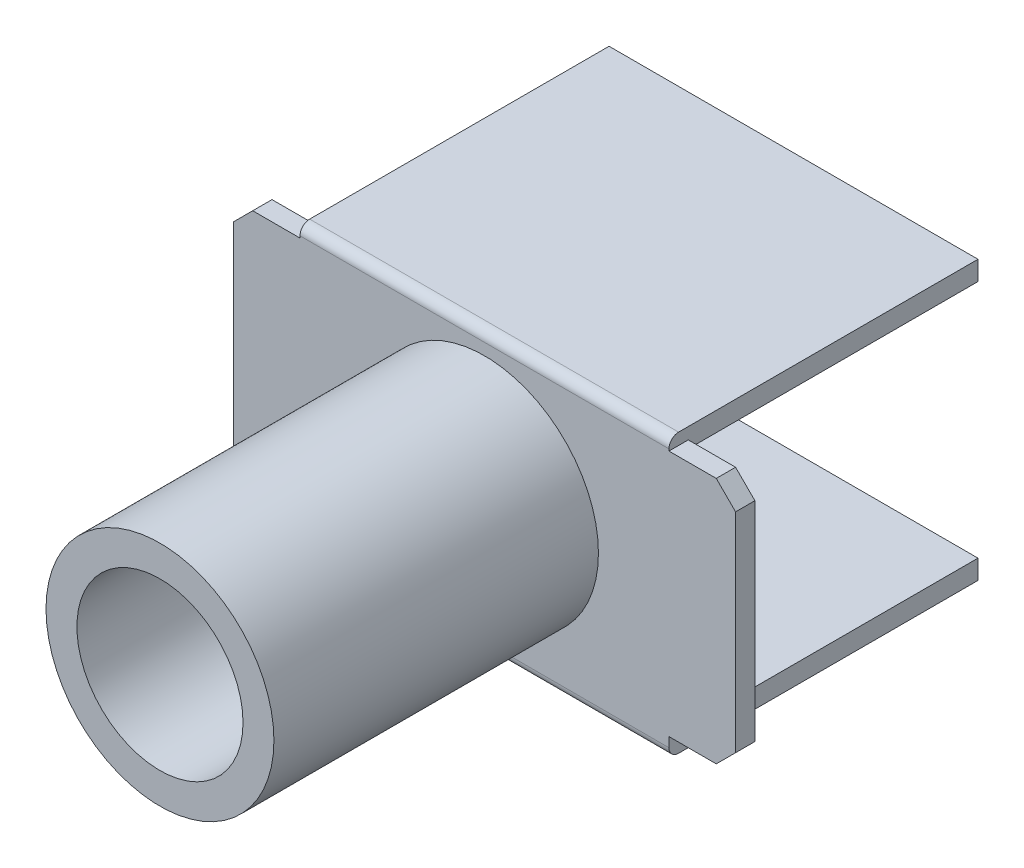
ISO-10303-21;
HEADER;
FILE_DESCRIPTION(('STEP AP214'),'2;1');
FILE_NAME('part.step','',(''),(''),'','','');
FILE_SCHEMA(('AUTOMOTIVE_DESIGN { 1 0 10303 214 1 1 1 1 }'));
ENDSEC;
DATA;
#1=APPLICATION_CONTEXT('core data for automotive mechanical design processes');
#2=APPLICATION_PROTOCOL_DEFINITION('international standard','automotive_design',2000,#1);
#3=PRODUCT_CONTEXT('',#1,'mechanical');
#4=PRODUCT('Part','Part','',(#3));
#5=PRODUCT_RELATED_PRODUCT_CATEGORY('part','',(#4));
#6=PRODUCT_DEFINITION_FORMATION('','',#4);
#7=PRODUCT_DEFINITION_CONTEXT('part definition',#1,'design');
#8=PRODUCT_DEFINITION('design','',#6,#7);
#9=PRODUCT_DEFINITION_SHAPE('','',#8);
#10=(LENGTH_UNIT() NAMED_UNIT(*) SI_UNIT(.MILLI.,.METRE.));
#11=(NAMED_UNIT(*) PLANE_ANGLE_UNIT() SI_UNIT($,.RADIAN.));
#12=(NAMED_UNIT(*) SI_UNIT($,.STERADIAN.) SOLID_ANGLE_UNIT());
#13=UNCERTAINTY_MEASURE_WITH_UNIT(LENGTH_MEASURE(1.E-05),#10,'distance_accuracy_value','');
#14=(GEOMETRIC_REPRESENTATION_CONTEXT(3) GLOBAL_UNCERTAINTY_ASSIGNED_CONTEXT((#13)) GLOBAL_UNIT_ASSIGNED_CONTEXT((#10,
#11,#12)) REPRESENTATION_CONTEXT('',''));
#15=CARTESIAN_POINT('',(0.,0.,0.));
#16=DIRECTION('',(0.,0.,1.));
#17=DIRECTION('',(1.,0.,0.));
#18=AXIS2_PLACEMENT_3D('',#15,#16,#17);
#19=CARTESIAN_POINT('',(-1.725,0.300000000000003,0.5));
#20=DIRECTION('',(1.,0.,0.));
#21=DIRECTION('',(0.,0.,-1.));
#22=AXIS2_PLACEMENT_3D('',#19,#20,#21);
#23=PLANE('',#22);
#24=DIRECTION('',(0.,0.,-1.));
#25=VECTOR('',#24,1.);
#26=CARTESIAN_POINT('',(-1.725,0.300000000000003,0.5));
#27=LINE('',#26,#25);
#28=CARTESIAN_POINT('',(-1.725,0.300000000000003,0.));
#29=VERTEX_POINT('',#28);
#30=CARTESIAN_POINT('',(-1.725,0.300000000000003,0.5));
#31=VERTEX_POINT('',#30);
#32=EDGE_CURVE('P0_E167',#29,#31,#27,.F.);
#33=ORIENTED_EDGE('',*,*,#32,.T.);
#34=DIRECTION('',(0.,1.,0.));
#35=VECTOR('',#34,1.);
#36=CARTESIAN_POINT('',(-1.725,0.300000000000003,0.5));
#37=LINE('',#36,#35);
#38=CARTESIAN_POINT('',(-1.725,0.0500000000000027,0.5));
#39=VERTEX_POINT('',#38);
#40=EDGE_CURVE('P0_E171',#31,#39,#37,.F.);
#41=ORIENTED_EDGE('',*,*,#40,.T.);
#42=CARTESIAN_POINT('',(-1.725,0.0500000000000036,0.25));
#43=DIRECTION('',(1.,0.,0.));
#44=DIRECTION('',(0.,1.,0.));
#45=AXIS2_PLACEMENT_3D('',#42,#43,#44);
#46=CIRCLE('',#45,0.25);
#47=CARTESIAN_POINT('',(-1.725,-0.199999999999997,0.25));
#48=VERTEX_POINT('',#47);
#49=EDGE_CURVE('P0_E20',#39,#48,#46,.T.);
#50=ORIENTED_EDGE('',*,*,#49,.T.);
#51=DIRECTION('',(0.,0.,1.));
#52=VECTOR('',#51,1.);
#53=CARTESIAN_POINT('',(-1.725,-0.199999999999997,-3.5));
#54=LINE('',#53,#52);
#55=CARTESIAN_POINT('',(-1.725,-0.199999999999997,-7.5));
#56=VERTEX_POINT('',#55);
#57=EDGE_CURVE('P0_E255',#48,#56,#54,.F.);
#58=ORIENTED_EDGE('',*,*,#57,.T.);
#59=DIRECTION('',(0.,1.,0.));
#60=VECTOR('',#59,1.);
#61=CARTESIAN_POINT('',(-1.725,0.300000000000003,-7.5));
#62=LINE('',#61,#60);
#63=CARTESIAN_POINT('',(-1.725,0.300000000000003,-7.5));
#64=VERTEX_POINT('',#63);
#65=EDGE_CURVE('P0_E179',#64,#56,#62,.F.);
#66=ORIENTED_EDGE('',*,*,#65,.F.);
#67=DIRECTION('',(0.,0.,1.));
#68=VECTOR('',#67,1.);
#69=CARTESIAN_POINT('',(-1.725,0.300000000000003,-3.5));
#70=LINE('',#69,#68);
#71=EDGE_CURVE('P0_E222',#29,#64,#70,.F.);
#72=ORIENTED_EDGE('',*,*,#71,.F.);
#73=EDGE_LOOP('',(#33,#41,#50,#58,#66,#72));
#74=FACE_BOUND('',#73,.T.);
#75=ADVANCED_FACE('P0_F17',(#74),#23,.T.);
#76=CARTESIAN_POINT('',(-1.725,0.300000000000003,-7.5));
#77=DIRECTION('',(0.,0.,-1.));
#78=DIRECTION('',(-1.,0.,0.));
#79=AXIS2_PLACEMENT_3D('',#76,#77,#78);
#80=PLANE('',#79);
#81=DIRECTION('',(1.,0.,0.));
#82=VECTOR('',#81,1.);
#83=CARTESIAN_POINT('',(-6.5,0.300000000000003,-7.5));
#84=LINE('',#83,#82);
#85=CARTESIAN_POINT('',(-11.275,0.300000000000002,-7.5));
#86=VERTEX_POINT('',#85);
#87=EDGE_CURVE('P0_E256',#64,#86,#84,.F.);
#88=ORIENTED_EDGE('',*,*,#87,.F.);
#89=ORIENTED_EDGE('',*,*,#65,.T.);
#90=DIRECTION('',(1.,0.,0.));
#91=VECTOR('',#90,1.);
#92=CARTESIAN_POINT('',(-6.5,-0.199999999999997,-7.5));
#93=LINE('',#92,#91);
#94=CARTESIAN_POINT('',(-11.275,-0.199999999999997,-7.5));
#95=VERTEX_POINT('',#94);
#96=EDGE_CURVE('P0_E309',#56,#95,#93,.F.);
#97=ORIENTED_EDGE('',*,*,#96,.T.);
#98=DIRECTION('',(0.,1.,0.));
#99=VECTOR('',#98,1.);
#100=CARTESIAN_POINT('',(-11.275,0.300000000000002,-7.5));
#101=LINE('',#100,#99);
#102=EDGE_CURVE('P0_E265',#86,#95,#101,.F.);
#103=ORIENTED_EDGE('',*,*,#102,.F.);
#104=EDGE_LOOP('',(#88,#89,#97,#103));
#105=FACE_BOUND('',#104,.T.);
#106=ADVANCED_FACE('P0_F324',(#105),#80,.T.);
#107=CARTESIAN_POINT('',(-11.275,0.300000000000002,-7.5));
#108=DIRECTION('',(-1.,0.,0.));
#109=DIRECTION('',(0.,0.,1.));
#110=AXIS2_PLACEMENT_3D('',#107,#108,#109);
#111=PLANE('',#110);
#112=ORIENTED_EDGE('',*,*,#102,.T.);
#113=DIRECTION('',(0.,0.,1.));
#114=VECTOR('',#113,1.);
#115=CARTESIAN_POINT('',(-11.275,-0.199999999999997,-3.5));
#116=LINE('',#115,#114);
#117=CARTESIAN_POINT('',(-11.275,-0.199999999999997,0.25));
#118=VERTEX_POINT('',#117);
#119=EDGE_CURVE('P0_E306',#95,#118,#116,.T.);
#120=ORIENTED_EDGE('',*,*,#119,.T.);
#121=CARTESIAN_POINT('',(-11.275,0.0500000000000024,0.25));
#122=DIRECTION('',(1.,0.,0.));
#123=DIRECTION('',(0.,1.,0.));
#124=AXIS2_PLACEMENT_3D('',#121,#122,#123);
#125=CIRCLE('',#124,0.25);
#126=CARTESIAN_POINT('',(-11.275,0.0500000000000021,0.5));
#127=VERTEX_POINT('',#126);
#128=EDGE_CURVE('P0_E182',#118,#127,#125,.F.);
#129=ORIENTED_EDGE('',*,*,#128,.T.);
#130=DIRECTION('',(0.,1.,0.));
#131=VECTOR('',#130,1.);
#132=CARTESIAN_POINT('',(-11.275,0.300000000000002,0.5));
#133=LINE('',#132,#131);
#134=CARTESIAN_POINT('',(-11.275,0.300000000000002,0.5));
#135=VERTEX_POINT('',#134);
#136=EDGE_CURVE('P0_E174',#127,#135,#133,.T.);
#137=ORIENTED_EDGE('',*,*,#136,.T.);
#138=DIRECTION('',(0.,0.,1.));
#139=VECTOR('',#138,1.);
#140=CARTESIAN_POINT('',(-11.275,0.300000000000002,-7.5));
#141=LINE('',#140,#139);
#142=CARTESIAN_POINT('',(-11.275,0.300000000000003,0.));
#143=VERTEX_POINT('',#142);
#144=EDGE_CURVE('P0_E263',#135,#143,#141,.F.);
#145=ORIENTED_EDGE('',*,*,#144,.T.);
#146=DIRECTION('',(0.,0.,1.));
#147=VECTOR('',#146,1.);
#148=CARTESIAN_POINT('',(-11.275,0.300000000000003,-3.5));
#149=LINE('',#148,#147);
#150=EDGE_CURVE('P0_E252',#86,#143,#149,.T.);
#151=ORIENTED_EDGE('',*,*,#150,.F.);
#152=EDGE_LOOP('',(#112,#120,#129,#137,#145,#151));
#153=FACE_BOUND('',#152,.T.);
#154=ADVANCED_FACE('P0_F327',(#153),#111,.T.);
#155=CARTESIAN_POINT('',(-1.725,6.50000015773294,-7.5));
#156=DIRECTION('',(1.,0.,0.));
#157=DIRECTION('',(0.,0.,-1.));
#158=AXIS2_PLACEMENT_3D('',#155,#156,#157);
#159=PLANE('',#158);
#160=DIRECTION('',(0.,1.,0.));
#161=VECTOR('',#160,1.);
#162=CARTESIAN_POINT('',(-1.725,6.50000015773294,-7.5));
#163=LINE('',#162,#161);
#164=CARTESIAN_POINT('',(-1.725,7.00000015773294,-7.5));
#165=VERTEX_POINT('',#164);
#166=CARTESIAN_POINT('',(-1.725,6.50000015773294,-7.5));
#167=VERTEX_POINT('',#166);
#168=EDGE_CURVE('P0_E293',#165,#167,#163,.F.);
#169=ORIENTED_EDGE('',*,*,#168,.F.);
#170=DIRECTION('',(0.,0.,1.));
#171=VECTOR('',#170,1.);
#172=CARTESIAN_POINT('',(-1.725,7.00000015773294,-3.5));
#173=LINE('',#172,#171);
#174=CARTESIAN_POINT('',(-1.725,7.00000015773294,0.25));
#175=VERTEX_POINT('',#174);
#176=EDGE_CURVE('P0_E308',#175,#165,#173,.F.);
#177=ORIENTED_EDGE('',*,*,#176,.F.);
#178=CARTESIAN_POINT('',(-1.725,6.75000015773294,0.25));
#179=DIRECTION('',(-1.,0.,0.));
#180=DIRECTION('',(0.,-1.,0.));
#181=AXIS2_PLACEMENT_3D('',#178,#179,#180);
#182=CIRCLE('',#181,0.25);
#183=CARTESIAN_POINT('',(-1.725,6.75000015773294,0.5));
#184=VERTEX_POINT('',#183);
#185=EDGE_CURVE('P0_E294',#175,#184,#182,.F.);
#186=ORIENTED_EDGE('',*,*,#185,.T.);
#187=DIRECTION('',(0.,1.,0.));
#188=VECTOR('',#187,1.);
#189=CARTESIAN_POINT('',(-1.725,6.50000015773294,0.5));
#190=LINE('',#189,#188);
#191=CARTESIAN_POINT('',(-1.725,6.70000000000001,0.5));
#192=VERTEX_POINT('',#191);
#193=EDGE_CURVE('P0_E244',#184,#192,#190,.F.);
#194=ORIENTED_EDGE('',*,*,#193,.T.);
#195=DIRECTION('',(0.,0.,-1.));
#196=VECTOR('',#195,1.);
#197=CARTESIAN_POINT('',(-1.725,6.70000000000001,-7.5));
#198=LINE('',#197,#196);
#199=CARTESIAN_POINT('',(-1.725,6.70000000000001,0.));
#200=VERTEX_POINT('',#199);
#201=EDGE_CURVE('P0_E240',#192,#200,#198,.T.);
#202=ORIENTED_EDGE('',*,*,#201,.T.);
#203=DIRECTION('',(0.,1.,0.));
#204=VECTOR('',#203,1.);
#205=CARTESIAN_POINT('',(-1.725,6.50000015773294,0.));
#206=LINE('',#205,#204);
#207=CARTESIAN_POINT('',(-1.725,6.50000015773294,0.));
#208=VERTEX_POINT('',#207);
#209=EDGE_CURVE('P0_E243',#200,#208,#206,.F.);
#210=ORIENTED_EDGE('',*,*,#209,.T.);
#211=DIRECTION('',(0.,0.,1.));
#212=VECTOR('',#211,1.);
#213=CARTESIAN_POINT('',(-1.725,6.50000015773294,-3.5));
#214=LINE('',#213,#212);
#215=EDGE_CURVE('P0_E234',#208,#167,#214,.F.);
#216=ORIENTED_EDGE('',*,*,#215,.T.);
#217=EDGE_LOOP('',(#169,#177,#186,#194,#202,#210,#216));
#218=FACE_BOUND('',#217,.T.);
#219=ADVANCED_FACE('P0_F418',(#218),#159,.T.);
#220=CARTESIAN_POINT('',(-11.275,6.50000015773294,-7.5));
#221=DIRECTION('',(0.,0.,-1.));
#222=DIRECTION('',(-1.,0.,0.));
#223=AXIS2_PLACEMENT_3D('',#220,#221,#222);
#224=PLANE('',#223);
#225=DIRECTION('',(1.,0.,0.));
#226=VECTOR('',#225,1.);
#227=CARTESIAN_POINT('',(-6.5,6.50000015773294,-7.5));
#228=LINE('',#227,#226);
#229=CARTESIAN_POINT('',(-11.275,6.50000015773294,-7.5));
#230=VERTEX_POINT('',#229);
#231=EDGE_CURVE('P0_E223',#167,#230,#228,.F.);
#232=ORIENTED_EDGE('',*,*,#231,.T.);
#233=DIRECTION('',(0.,1.,0.));
#234=VECTOR('',#233,1.);
#235=CARTESIAN_POINT('',(-11.275,6.50000015773294,-7.5));
#236=LINE('',#235,#234);
#237=CARTESIAN_POINT('',(-11.275,7.00000015773294,-7.5));
#238=VERTEX_POINT('',#237);
#239=EDGE_CURVE('P0_E216',#238,#230,#236,.F.);
#240=ORIENTED_EDGE('',*,*,#239,.F.);
#241=DIRECTION('',(1.,0.,0.));
#242=VECTOR('',#241,1.);
#243=CARTESIAN_POINT('',(-6.5,7.00000015773294,-7.5));
#244=LINE('',#243,#242);
#245=EDGE_CURVE('P0_E395',#165,#238,#244,.F.);
#246=ORIENTED_EDGE('',*,*,#245,.F.);
#247=ORIENTED_EDGE('',*,*,#168,.T.);
#248=EDGE_LOOP('',(#232,#240,#246,#247));
#249=FACE_BOUND('',#248,.T.);
#250=ADVANCED_FACE('P0_F432',(#249),#224,.T.);
#251=CARTESIAN_POINT('',(-11.275,6.50000015773294,0.5));
#252=DIRECTION('',(-1.,0.,0.));
#253=DIRECTION('',(0.,0.,1.));
#254=AXIS2_PLACEMENT_3D('',#251,#252,#253);
#255=PLANE('',#254);
#256=DIRECTION('',(0.,0.,1.));
#257=VECTOR('',#256,1.);
#258=CARTESIAN_POINT('',(-11.275,6.70000000000001,0.5));
#259=LINE('',#258,#257);
#260=CARTESIAN_POINT('',(-11.275,6.70000000000001,0.));
#261=VERTEX_POINT('',#260);
#262=CARTESIAN_POINT('',(-11.275,6.70000000000001,0.5));
#263=VERTEX_POINT('',#262);
#264=EDGE_CURVE('P0_E201',#261,#263,#259,.T.);
#265=ORIENTED_EDGE('',*,*,#264,.T.);
#266=DIRECTION('',(0.,1.,0.));
#267=VECTOR('',#266,1.);
#268=CARTESIAN_POINT('',(-11.275,6.50000015773294,0.5));
#269=LINE('',#268,#267);
#270=CARTESIAN_POINT('',(-11.275,6.75000015773294,0.5));
#271=VERTEX_POINT('',#270);
#272=EDGE_CURVE('P0_E204',#263,#271,#269,.T.);
#273=ORIENTED_EDGE('',*,*,#272,.T.);
#274=CARTESIAN_POINT('',(-11.275,6.75000015773294,0.25));
#275=DIRECTION('',(-1.,0.,0.));
#276=DIRECTION('',(0.,-1.,0.));
#277=AXIS2_PLACEMENT_3D('',#274,#275,#276);
#278=CIRCLE('',#277,0.25);
#279=CARTESIAN_POINT('',(-11.275,7.00000015773294,0.25));
#280=VERTEX_POINT('',#279);
#281=EDGE_CURVE('P0_E291',#271,#280,#278,.T.);
#282=ORIENTED_EDGE('',*,*,#281,.T.);
#283=DIRECTION('',(0.,0.,1.));
#284=VECTOR('',#283,1.);
#285=CARTESIAN_POINT('',(-11.275,7.00000015773294,-3.5));
#286=LINE('',#285,#284);
#287=EDGE_CURVE('P0_E230',#238,#280,#286,.T.);
#288=ORIENTED_EDGE('',*,*,#287,.F.);
#289=ORIENTED_EDGE('',*,*,#239,.T.);
#290=DIRECTION('',(0.,0.,1.));
#291=VECTOR('',#290,1.);
#292=CARTESIAN_POINT('',(-11.275,6.50000015773294,-3.5));
#293=LINE('',#292,#291);
#294=CARTESIAN_POINT('',(-11.275,6.50000015773294,0.));
#295=VERTEX_POINT('',#294);
#296=EDGE_CURVE('P0_E219',#230,#295,#293,.T.);
#297=ORIENTED_EDGE('',*,*,#296,.T.);
#298=DIRECTION('',(0.,1.,0.));
#299=VECTOR('',#298,1.);
#300=CARTESIAN_POINT('',(-11.275,6.50000015773294,0.));
#301=LINE('',#300,#299);
#302=EDGE_CURVE('P0_E205',#295,#261,#301,.T.);
#303=ORIENTED_EDGE('',*,*,#302,.T.);
#304=EDGE_LOOP('',(#265,#273,#282,#288,#289,#297,#303));
#305=FACE_BOUND('',#304,.T.);
#306=ADVANCED_FACE('P0_F427',(#305),#255,.T.);
#307=CARTESIAN_POINT('',(-6.5,6.50000015773294,-3.5));
#308=DIRECTION('',(0.,1.,0.));
#309=DIRECTION('',(0.,0.,1.));
#310=AXIS2_PLACEMENT_3D('',#307,#308,#309);
#311=PLANE('',#310);
#312=ORIENTED_EDGE('',*,*,#296,.F.);
#313=ORIENTED_EDGE('',*,*,#231,.F.);
#314=ORIENTED_EDGE('',*,*,#215,.F.);
#315=DIRECTION('',(1.,0.,0.));
#316=VECTOR('',#315,1.);
#317=CARTESIAN_POINT('',(-6.5,6.50000015773294,0.));
#318=LINE('',#317,#316);
#319=EDGE_CURVE('P0_E226',#208,#295,#318,.F.);
#320=ORIENTED_EDGE('',*,*,#319,.T.);
#321=EDGE_LOOP('',(#312,#313,#314,#320));
#322=FACE_BOUND('',#321,.T.);
#323=ADVANCED_FACE('P0_F436',(#322),#311,.F.);
#324=CARTESIAN_POINT('',(-6.5,0.300000000000003,-3.5));
#325=DIRECTION('',(0.,1.,0.));
#326=DIRECTION('',(0.,0.,1.));
#327=AXIS2_PLACEMENT_3D('',#324,#325,#326);
#328=PLANE('',#327);
#329=ORIENTED_EDGE('',*,*,#87,.T.);
#330=ORIENTED_EDGE('',*,*,#150,.T.);
#331=DIRECTION('',(1.,0.,0.));
#332=VECTOR('',#331,1.);
#333=CARTESIAN_POINT('',(-6.5,0.300000000000002,0.));
#334=LINE('',#333,#332);
#335=EDGE_CURVE('P0_E280',#143,#29,#334,.T.);
#336=ORIENTED_EDGE('',*,*,#335,.T.);
#337=ORIENTED_EDGE('',*,*,#71,.T.);
#338=EDGE_LOOP('',(#329,#330,#336,#337));
#339=FACE_BOUND('',#338,.T.);
#340=ADVANCED_FACE('P0_F332',(#339),#328,.T.);
#341=CARTESIAN_POINT('',(-6.5,-0.199999999999997,-3.5));
#342=DIRECTION('',(0.,1.,0.));
#343=DIRECTION('',(0.,0.,1.));
#344=AXIS2_PLACEMENT_3D('',#341,#342,#343);
#345=PLANE('',#344);
#346=ORIENTED_EDGE('',*,*,#119,.F.);
#347=ORIENTED_EDGE('',*,*,#96,.F.);
#348=ORIENTED_EDGE('',*,*,#57,.F.);
#349=DIRECTION('',(1.,0.,0.));
#350=VECTOR('',#349,1.);
#351=CARTESIAN_POINT('',(-6.5,-0.199999999999997,0.25));
#352=LINE('',#351,#350);
#353=EDGE_CURVE('P0_E163',#118,#48,#352,.T.);
#354=ORIENTED_EDGE('',*,*,#353,.F.);
#355=EDGE_LOOP('',(#346,#347,#348,#354));
#356=FACE_BOUND('',#355,.T.);
#357=ADVANCED_FACE('P0_F326',(#356),#345,.F.);
#358=CARTESIAN_POINT('',(-6.5,7.00000015773294,-3.5));
#359=DIRECTION('',(0.,1.,0.));
#360=DIRECTION('',(0.,0.,1.));
#361=AXIS2_PLACEMENT_3D('',#358,#359,#360);
#362=PLANE('',#361);
#363=ORIENTED_EDGE('',*,*,#245,.T.);
#364=ORIENTED_EDGE('',*,*,#287,.T.);
#365=DIRECTION('',(-1.,0.,0.));
#366=VECTOR('',#365,1.);
#367=CARTESIAN_POINT('',(-6.5,7.00000015773294,0.25));
#368=LINE('',#367,#366);
#369=EDGE_CURVE('P0_E211',#175,#280,#368,.T.);
#370=ORIENTED_EDGE('',*,*,#369,.F.);
#371=ORIENTED_EDGE('',*,*,#176,.T.);
#372=EDGE_LOOP('',(#363,#364,#370,#371));
#373=FACE_BOUND('',#372,.T.);
#374=ADVANCED_FACE('P0_F429',(#373),#362,.T.);
#375=CARTESIAN_POINT('',(-6.5,3.5,0.));
#376=DIRECTION('',(0.,0.,1.));
#377=DIRECTION('',(1.,0.,0.));
#378=AXIS2_PLACEMENT_3D('',#375,#376,#377);
#379=PLANE('',#378);
#380=DIRECTION('',(1.,0.,0.));
#381=VECTOR('',#380,1.);
#382=CARTESIAN_POINT('',(-13.,6.70000000000001,0.));
#383=LINE('',#382,#381);
#384=CARTESIAN_POINT('',(-0.5,6.70000000000001,0.));
#385=VERTEX_POINT('',#384);
#386=EDGE_CURVE('P0_E369',#385,#200,#383,.F.);
#387=ORIENTED_EDGE('',*,*,#386,.F.);
#388=DIRECTION('',(-0.707106781186547,0.707106781186548,0.));
#389=VECTOR('',#388,1.);
#390=CARTESIAN_POINT('',(-0.25,6.45000000000001,0.));
#391=LINE('',#390,#389);
#392=CARTESIAN_POINT('',(0.,6.20000000000001,0.));
#393=VERTEX_POINT('',#392);
#394=EDGE_CURVE('P0_E375',#393,#385,#391,.T.);
#395=ORIENTED_EDGE('',*,*,#394,.F.);
#396=DIRECTION('',(0.,1.,0.));
#397=VECTOR('',#396,1.);
#398=CARTESIAN_POINT('',(0.,6.70000000000001,0.));
#399=LINE('',#398,#397);
#400=CARTESIAN_POINT('',(0.,0.800000000000004,0.));
#401=VERTEX_POINT('',#400);
#402=EDGE_CURVE('P0_E380',#401,#393,#399,.T.);
#403=ORIENTED_EDGE('',*,*,#402,.F.);
#404=DIRECTION('',(0.707106781186547,0.707106781186548,0.));
#405=VECTOR('',#404,1.);
#406=CARTESIAN_POINT('',(-0.25,0.550000000000004,0.));
#407=LINE('',#406,#405);
#408=CARTESIAN_POINT('',(-0.5,0.300000000000004,0.));
#409=VERTEX_POINT('',#408);
#410=EDGE_CURVE('P0_E340',#409,#401,#407,.T.);
#411=ORIENTED_EDGE('',*,*,#410,.F.);
#412=DIRECTION('',(1.,0.,0.));
#413=VECTOR('',#412,1.);
#414=CARTESIAN_POINT('',(0.,0.300000000000004,0.));
#415=LINE('',#414,#413);
#416=EDGE_CURVE('P0_E286',#29,#409,#415,.T.);
#417=ORIENTED_EDGE('',*,*,#416,.F.);
#418=ORIENTED_EDGE('',*,*,#335,.F.);
#419=DIRECTION('',(1.,0.,0.));
#420=VECTOR('',#419,1.);
#421=CARTESIAN_POINT('',(-6.5,0.300000000000002,0.));
#422=LINE('',#421,#420);
#423=CARTESIAN_POINT('',(-12.5,0.300000000000003,0.));
#424=VERTEX_POINT('',#423);
#425=EDGE_CURVE('P0_E283',#424,#143,#422,.T.);
#426=ORIENTED_EDGE('',*,*,#425,.F.);
#427=DIRECTION('',(0.707106781186548,-0.707106781186547,0.));
#428=VECTOR('',#427,1.);
#429=CARTESIAN_POINT('',(-13.,0.800000000000002,0.));
#430=LINE('',#429,#428);
#431=CARTESIAN_POINT('',(-13.,0.800000000000003,0.));
#432=VERTEX_POINT('',#431);
#433=EDGE_CURVE('P0_E229',#432,#424,#430,.T.);
#434=ORIENTED_EDGE('',*,*,#433,.F.);
#435=DIRECTION('',(0.,1.,0.));
#436=VECTOR('',#435,1.);
#437=CARTESIAN_POINT('',(-13.,0.300000000000002,0.));
#438=LINE('',#437,#436);
#439=CARTESIAN_POINT('',(-13.,6.20000000000001,0.));
#440=VERTEX_POINT('',#439);
#441=EDGE_CURVE('P0_E359',#440,#432,#438,.F.);
#442=ORIENTED_EDGE('',*,*,#441,.F.);
#443=DIRECTION('',(-0.707106781186548,-0.707106781186548,0.));
#444=VECTOR('',#443,1.);
#445=CARTESIAN_POINT('',(-12.75,6.45000000000001,0.));
#446=LINE('',#445,#444);
#447=CARTESIAN_POINT('',(-12.5,6.70000000000001,0.));
#448=VERTEX_POINT('',#447);
#449=EDGE_CURVE('P0_E365',#448,#440,#446,.T.);
#450=ORIENTED_EDGE('',*,*,#449,.F.);
#451=DIRECTION('',(1.,0.,0.));
#452=VECTOR('',#451,1.);
#453=CARTESIAN_POINT('',(-13.,6.70000000000001,0.));
#454=LINE('',#453,#452);
#455=EDGE_CURVE('P0_E208',#261,#448,#454,.F.);
#456=ORIENTED_EDGE('',*,*,#455,.F.);
#457=ORIENTED_EDGE('',*,*,#302,.F.);
#458=ORIENTED_EDGE('',*,*,#319,.F.);
#459=ORIENTED_EDGE('',*,*,#209,.F.);
#460=EDGE_LOOP('',(#387,#395,#403,#411,#417,#418,#426,#434,#442,#450,#456,#457,#458,#459));
#461=FACE_BOUND('',#460,.T.);
#462=ADVANCED_FACE('P0_F338',(#461),#379,.F.);
#463=CARTESIAN_POINT('',(-6.5,0.050000000000003,0.25));
#464=DIRECTION('',(1.,0.,0.));
#465=DIRECTION('',(0.,1.,0.));
#466=AXIS2_PLACEMENT_3D('',#463,#464,#465);
#467=CYLINDRICAL_SURFACE('',#466,0.25);
#468=ORIENTED_EDGE('',*,*,#128,.F.);
#469=ORIENTED_EDGE('',*,*,#353,.T.);
#470=ORIENTED_EDGE('',*,*,#49,.F.);
#471=DIRECTION('',(1.,0.,0.));
#472=VECTOR('',#471,1.);
#473=CARTESIAN_POINT('',(-6.5,0.0500000000000019,0.5));
#474=LINE('',#473,#472);
#475=EDGE_CURVE('P0_E160',#127,#39,#474,.T.);
#476=ORIENTED_EDGE('',*,*,#475,.F.);
#477=EDGE_LOOP('',(#468,#469,#470,#476));
#478=FACE_BOUND('',#477,.T.);
#479=ADVANCED_FACE('P0_F159',(#478),#467,.T.);
#480=CARTESIAN_POINT('',(0.,0.300000000000004,0.));
#481=DIRECTION('',(0.,-1.,0.));
#482=DIRECTION('',(0.,0.,-1.));
#483=AXIS2_PLACEMENT_3D('',#480,#481,#482);
#484=PLANE('',#483);
#485=DIRECTION('',(0.,0.,1.));
#486=VECTOR('',#485,1.);
#487=CARTESIAN_POINT('',(-0.5,0.300000000000004,0.));
#488=LINE('',#487,#486);
#489=CARTESIAN_POINT('',(-0.5,0.300000000000004,0.5));
#490=VERTEX_POINT('',#489);
#491=EDGE_CURVE('P0_E288',#490,#409,#488,.F.);
#492=ORIENTED_EDGE('',*,*,#491,.F.);
#493=DIRECTION('',(1.,0.,0.));
#494=VECTOR('',#493,1.);
#495=CARTESIAN_POINT('',(-6.5,0.300000000000003,0.5));
#496=LINE('',#495,#494);
#497=EDGE_CURVE('P0_E175',#31,#490,#496,.T.);
#498=ORIENTED_EDGE('',*,*,#497,.F.);
#499=ORIENTED_EDGE('',*,*,#32,.F.);
#500=ORIENTED_EDGE('',*,*,#416,.T.);
#501=EDGE_LOOP('',(#492,#498,#499,#500));
#502=FACE_BOUND('',#501,.T.);
#503=ADVANCED_FACE('P0_F343',(#502),#484,.T.);
#504=CARTESIAN_POINT('',(-0.25,0.550000000000004,0.));
#505=DIRECTION('',(0.707106781186548,-0.707106781186547,0.));
#506=DIRECTION('',(0.707106781186547,0.707106781186548,0.));
#507=AXIS2_PLACEMENT_3D('',#504,#505,#506);
#508=PLANE('',#507);
#509=ORIENTED_EDGE('',*,*,#410,.T.);
#510=DIRECTION('',(0.,0.,-1.));
#511=VECTOR('',#510,1.);
#512=CARTESIAN_POINT('',(0.,0.800000000000004,0.));
#513=LINE('',#512,#511);
#514=CARTESIAN_POINT('',(0.,0.800000000000004,0.5));
#515=VERTEX_POINT('',#514);
#516=EDGE_CURVE('P0_E382',#515,#401,#513,.T.);
#517=ORIENTED_EDGE('',*,*,#516,.F.);
#518=DIRECTION('',(0.707106781186548,0.707106781186547,0.));
#519=VECTOR('',#518,1.);
#520=CARTESIAN_POINT('',(-0.5,0.300000000000004,0.5));
#521=LINE('',#520,#519);
#522=EDGE_CURVE('P0_E275',#490,#515,#521,.T.);
#523=ORIENTED_EDGE('',*,*,#522,.F.);
#524=ORIENTED_EDGE('',*,*,#491,.T.);
#525=EDGE_LOOP('',(#509,#517,#523,#524));
#526=FACE_BOUND('',#525,.T.);
#527=ADVANCED_FACE('P0_F462',(#526),#508,.T.);
#528=CARTESIAN_POINT('',(0.,6.70000000000001,0.));
#529=DIRECTION('',(1.,0.,0.));
#530=DIRECTION('',(0.,0.,-1.));
#531=AXIS2_PLACEMENT_3D('',#528,#529,#530);
#532=PLANE('',#531);
#533=ORIENTED_EDGE('',*,*,#516,.T.);
#534=ORIENTED_EDGE('',*,*,#402,.T.);
#535=DIRECTION('',(0.,0.,1.));
#536=VECTOR('',#535,1.);
#537=CARTESIAN_POINT('',(0.,6.20000000000001,0.));
#538=LINE('',#537,#536);
#539=CARTESIAN_POINT('',(0.,6.20000000000001,0.5));
#540=VERTEX_POINT('',#539);
#541=EDGE_CURVE('P0_E377',#540,#393,#538,.F.);
#542=ORIENTED_EDGE('',*,*,#541,.F.);
#543=DIRECTION('',(0.,1.,0.));
#544=VECTOR('',#543,1.);
#545=CARTESIAN_POINT('',(0.,3.5,0.5));
#546=LINE('',#545,#544);
#547=EDGE_CURVE('P0_E349',#515,#540,#546,.T.);
#548=ORIENTED_EDGE('',*,*,#547,.F.);
#549=EDGE_LOOP('',(#533,#534,#542,#548));
#550=FACE_BOUND('',#549,.T.);
#551=ADVANCED_FACE('P0_F461',(#550),#532,.T.);
#552=CARTESIAN_POINT('',(-0.25,6.45000000000001,0.));
#553=DIRECTION('',(0.707106781186548,0.707106781186547,0.));
#554=DIRECTION('',(-0.707106781186547,0.707106781186548,0.));
#555=AXIS2_PLACEMENT_3D('',#552,#553,#554);
#556=PLANE('',#555);
#557=ORIENTED_EDGE('',*,*,#394,.T.);
#558=DIRECTION('',(0.,0.,1.));
#559=VECTOR('',#558,1.);
#560=CARTESIAN_POINT('',(-0.5,6.70000000000001,0.));
#561=LINE('',#560,#559);
#562=CARTESIAN_POINT('',(-0.5,6.70000000000001,0.5));
#563=VERTEX_POINT('',#562);
#564=EDGE_CURVE('P0_E372',#563,#385,#561,.F.);
#565=ORIENTED_EDGE('',*,*,#564,.F.);
#566=DIRECTION('',(-0.707106781186548,0.707106781186547,0.));
#567=VECTOR('',#566,1.);
#568=CARTESIAN_POINT('',(0.,6.20000000000001,0.5));
#569=LINE('',#568,#567);
#570=EDGE_CURVE('P0_E249',#540,#563,#569,.T.);
#571=ORIENTED_EDGE('',*,*,#570,.F.);
#572=ORIENTED_EDGE('',*,*,#541,.T.);
#573=EDGE_LOOP('',(#557,#565,#571,#572));
#574=FACE_BOUND('',#573,.T.);
#575=ADVANCED_FACE('P0_F456',(#574),#556,.T.);
#576=CARTESIAN_POINT('',(-13.,6.70000000000001,0.));
#577=DIRECTION('',(0.,1.,0.));
#578=DIRECTION('',(0.,0.,1.));
#579=AXIS2_PLACEMENT_3D('',#576,#577,#578);
#580=PLANE('',#579);
#581=ORIENTED_EDGE('',*,*,#564,.T.);
#582=ORIENTED_EDGE('',*,*,#386,.T.);
#583=ORIENTED_EDGE('',*,*,#201,.F.);
#584=DIRECTION('',(1.,0.,0.));
#585=VECTOR('',#584,1.);
#586=CARTESIAN_POINT('',(-6.5,6.70000000000001,0.5));
#587=LINE('',#586,#585);
#588=EDGE_CURVE('P0_E195',#563,#192,#587,.F.);
#589=ORIENTED_EDGE('',*,*,#588,.F.);
#590=EDGE_LOOP('',(#581,#582,#583,#589));
#591=FACE_BOUND('',#590,.T.);
#592=ADVANCED_FACE('P0_F459',(#591),#580,.T.);
#593=CARTESIAN_POINT('',(-6.5,6.75000015773294,0.25));
#594=DIRECTION('',(-1.,0.,0.));
#595=DIRECTION('',(0.,-1.,0.));
#596=AXIS2_PLACEMENT_3D('',#593,#594,#595);
#597=CYLINDRICAL_SURFACE('',#596,0.25);
#598=ORIENTED_EDGE('',*,*,#185,.F.);
#599=ORIENTED_EDGE('',*,*,#369,.T.);
#600=ORIENTED_EDGE('',*,*,#281,.F.);
#601=DIRECTION('',(1.,0.,0.));
#602=VECTOR('',#601,1.);
#603=CARTESIAN_POINT('',(-6.5,6.75000015773294,0.5));
#604=LINE('',#603,#602);
#605=EDGE_CURVE('P0_E191',#184,#271,#604,.F.);
#606=ORIENTED_EDGE('',*,*,#605,.F.);
#607=EDGE_LOOP('',(#598,#599,#600,#606));
#608=FACE_BOUND('',#607,.T.);
#609=ADVANCED_FACE('P0_F423',(#608),#597,.T.);
#610=CARTESIAN_POINT('',(-13.,6.70000000000001,0.));
#611=DIRECTION('',(0.,1.,0.));
#612=DIRECTION('',(0.,0.,1.));
#613=AXIS2_PLACEMENT_3D('',#610,#611,#612);
#614=PLANE('',#613);
#615=DIRECTION('',(0.,0.,1.));
#616=VECTOR('',#615,1.);
#617=CARTESIAN_POINT('',(-12.5,6.70000000000001,0.));
#618=LINE('',#617,#616);
#619=CARTESIAN_POINT('',(-12.5,6.70000000000001,0.5));
#620=VERTEX_POINT('',#619);
#621=EDGE_CURVE('P0_E210',#620,#448,#618,.F.);
#622=ORIENTED_EDGE('',*,*,#621,.F.);
#623=DIRECTION('',(1.,0.,0.));
#624=VECTOR('',#623,1.);
#625=CARTESIAN_POINT('',(-6.5,6.70000000000001,0.5));
#626=LINE('',#625,#624);
#627=EDGE_CURVE('P0_E194',#263,#620,#626,.F.);
#628=ORIENTED_EDGE('',*,*,#627,.F.);
#629=ORIENTED_EDGE('',*,*,#264,.F.);
#630=ORIENTED_EDGE('',*,*,#455,.T.);
#631=EDGE_LOOP('',(#622,#628,#629,#630));
#632=FACE_BOUND('',#631,.T.);
#633=ADVANCED_FACE('P0_F443',(#632),#614,.T.);
#634=CARTESIAN_POINT('',(-12.75,6.45000000000001,0.));
#635=DIRECTION('',(-0.707106781186548,0.707106781186548,0.));
#636=DIRECTION('',(-0.707106781186548,-0.707106781186548,0.));
#637=AXIS2_PLACEMENT_3D('',#634,#635,#636);
#638=PLANE('',#637);
#639=ORIENTED_EDGE('',*,*,#449,.T.);
#640=DIRECTION('',(0.,0.,1.));
#641=VECTOR('',#640,1.);
#642=CARTESIAN_POINT('',(-13.,6.20000000000001,0.));
#643=LINE('',#642,#641);
#644=CARTESIAN_POINT('',(-13.,6.20000000000001,0.5));
#645=VERTEX_POINT('',#644);
#646=EDGE_CURVE('P0_E362',#645,#440,#643,.F.);
#647=ORIENTED_EDGE('',*,*,#646,.F.);
#648=DIRECTION('',(-0.707106781186549,-0.707106781186546,0.));
#649=VECTOR('',#648,1.);
#650=CARTESIAN_POINT('',(-12.5,6.70000000000001,0.5));
#651=LINE('',#650,#649);
#652=EDGE_CURVE('P0_E198',#620,#645,#651,.T.);
#653=ORIENTED_EDGE('',*,*,#652,.F.);
#654=ORIENTED_EDGE('',*,*,#621,.T.);
#655=EDGE_LOOP('',(#639,#647,#653,#654));
#656=FACE_BOUND('',#655,.T.);
#657=ADVANCED_FACE('P0_F487',(#656),#638,.T.);
#658=CARTESIAN_POINT('',(-13.,0.300000000000002,0.));
#659=DIRECTION('',(-1.,0.,0.));
#660=DIRECTION('',(0.,0.,1.));
#661=AXIS2_PLACEMENT_3D('',#658,#659,#660);
#662=PLANE('',#661);
#663=DIRECTION('',(0.,0.,1.));
#664=VECTOR('',#663,1.);
#665=CARTESIAN_POINT('',(-13.,0.800000000000002,0.));
#666=LINE('',#665,#664);
#667=CARTESIAN_POINT('',(-13.,0.800000000000003,0.5));
#668=VERTEX_POINT('',#667);
#669=EDGE_CURVE('P0_E356',#668,#432,#666,.F.);
#670=ORIENTED_EDGE('',*,*,#669,.F.);
#671=DIRECTION('',(0.,1.,0.));
#672=VECTOR('',#671,1.);
#673=CARTESIAN_POINT('',(-13.,3.5,0.5));
#674=LINE('',#673,#672);
#675=EDGE_CURVE('P0_E449',#645,#668,#674,.F.);
#676=ORIENTED_EDGE('',*,*,#675,.F.);
#677=ORIENTED_EDGE('',*,*,#646,.T.);
#678=ORIENTED_EDGE('',*,*,#441,.T.);
#679=EDGE_LOOP('',(#670,#676,#677,#678));
#680=FACE_BOUND('',#679,.T.);
#681=ADVANCED_FACE('P0_F484',(#680),#662,.T.);
#682=CARTESIAN_POINT('',(-12.75,0.550000000000002,0.));
#683=DIRECTION('',(-0.707106781186547,-0.707106781186548,0.));
#684=DIRECTION('',(0.707106781186548,-0.707106781186547,0.));
#685=AXIS2_PLACEMENT_3D('',#682,#683,#684);
#686=PLANE('',#685);
#687=ORIENTED_EDGE('',*,*,#433,.T.);
#688=DIRECTION('',(0.,0.,-1.));
#689=VECTOR('',#688,1.);
#690=CARTESIAN_POINT('',(-12.5,0.300000000000004,0.));
#691=LINE('',#690,#689);
#692=CARTESIAN_POINT('',(-12.5,0.300000000000003,0.5));
#693=VERTEX_POINT('',#692);
#694=EDGE_CURVE('P0_E35',#693,#424,#691,.T.);
#695=ORIENTED_EDGE('',*,*,#694,.F.);
#696=DIRECTION('',(0.707106781186548,-0.707106781186547,0.));
#697=VECTOR('',#696,1.);
#698=CARTESIAN_POINT('',(-13.,0.800000000000002,0.5));
#699=LINE('',#698,#697);
#700=EDGE_CURVE('P0_E26',#668,#693,#699,.T.);
#701=ORIENTED_EDGE('',*,*,#700,.F.);
#702=ORIENTED_EDGE('',*,*,#669,.T.);
#703=EDGE_LOOP('',(#687,#695,#701,#702));
#704=FACE_BOUND('',#703,.T.);
#705=ADVANCED_FACE('P0_F478',(#704),#686,.T.);
#706=CARTESIAN_POINT('',(0.,0.300000000000004,0.));
#707=DIRECTION('',(0.,-1.,0.));
#708=DIRECTION('',(0.,0.,-1.));
#709=AXIS2_PLACEMENT_3D('',#706,#707,#708);
#710=PLANE('',#709);
#711=ORIENTED_EDGE('',*,*,#694,.T.);
#712=ORIENTED_EDGE('',*,*,#425,.T.);
#713=ORIENTED_EDGE('',*,*,#144,.F.);
#714=DIRECTION('',(1.,0.,0.));
#715=VECTOR('',#714,1.);
#716=CARTESIAN_POINT('',(-6.5,0.300000000000002,0.5));
#717=LINE('',#716,#715);
#718=EDGE_CURVE('P0_E11',#693,#135,#717,.T.);
#719=ORIENTED_EDGE('',*,*,#718,.F.);
#720=EDGE_LOOP('',(#711,#712,#713,#719));
#721=FACE_BOUND('',#720,.T.);
#722=ADVANCED_FACE('P0_F473',(#721),#710,.T.);
#723=CARTESIAN_POINT('',(-6.5,3.5,0.5));
#724=DIRECTION('',(0.,0.,1.));
#725=DIRECTION('',(1.,0.,0.));
#726=AXIS2_PLACEMENT_3D('',#723,#724,#725);
#727=PLANE('',#726);
#728=ORIENTED_EDGE('',*,*,#718,.T.);
#729=ORIENTED_EDGE('',*,*,#136,.F.);
#730=ORIENTED_EDGE('',*,*,#475,.T.);
#731=ORIENTED_EDGE('',*,*,#40,.F.);
#732=ORIENTED_EDGE('',*,*,#497,.T.);
#733=ORIENTED_EDGE('',*,*,#522,.T.);
#734=ORIENTED_EDGE('',*,*,#547,.T.);
#735=ORIENTED_EDGE('',*,*,#570,.T.);
#736=ORIENTED_EDGE('',*,*,#588,.T.);
#737=ORIENTED_EDGE('',*,*,#193,.F.);
#738=ORIENTED_EDGE('',*,*,#605,.T.);
#739=ORIENTED_EDGE('',*,*,#272,.F.);
#740=ORIENTED_EDGE('',*,*,#627,.T.);
#741=ORIENTED_EDGE('',*,*,#652,.T.);
#742=ORIENTED_EDGE('',*,*,#675,.T.);
#743=ORIENTED_EDGE('',*,*,#700,.T.);
#744=EDGE_LOOP('',(#728,#729,#730,#731,#732,#733,#734,#735,#736,#737,#738,#739,#740,#741,#742,#743));
#745=FACE_BOUND('',#744,.T.);
#746=ADVANCED_FACE('P0_F169',(#745),#727,.T.);
#747=CLOSED_SHELL('',(#75,#106,#154,#219,#250,#306,#323,#340,#357,#374,#462,#479,#503,#527,#551,
#575,#592,#609,#633,#657,#681,#705,#722,#746));
#748=MANIFOLD_SOLID_BREP('P0_B1',#747);
#749=CARTESIAN_POINT('',(-6.5,3.5,0.5));
#750=DIRECTION('',(0.,0.,1.));
#751=DIRECTION('',(1.,0.,0.));
#752=AXIS2_PLACEMENT_3D('',#749,#750,#751);
#753=CYLINDRICAL_SURFACE('',#752,2.15);
#754=CARTESIAN_POINT('',(-6.5,3.5,0.5));
#755=DIRECTION('',(0.,0.,1.));
#756=DIRECTION('',(1.,0.,0.));
#757=AXIS2_PLACEMENT_3D('',#754,#755,#756);
#758=CIRCLE('',#757,2.15);
#759=CARTESIAN_POINT('',(-4.35,3.5,0.5));
#760=VERTEX_POINT('',#759);
#761=EDGE_CURVE('P1_E27',#760,#760,#758,.T.);
#762=ORIENTED_EDGE('',*,*,#761,.F.);
#763=EDGE_LOOP('',(#762));
#764=FACE_BOUND('',#763,.T.);
#765=CARTESIAN_POINT('',(-6.5,3.5,8.9));
#766=DIRECTION('',(0.,0.,1.));
#767=DIRECTION('',(1.,0.,0.));
#768=AXIS2_PLACEMENT_3D('',#765,#766,#767);
#769=CIRCLE('',#768,2.15);
#770=CARTESIAN_POINT('',(-4.35,3.5,8.9));
#771=VERTEX_POINT('',#770);
#772=EDGE_CURVE('P1_E18',#771,#771,#769,.T.);
#773=ORIENTED_EDGE('',*,*,#772,.T.);
#774=EDGE_LOOP('',(#773));
#775=FACE_BOUND('',#774,.T.);
#776=ADVANCED_FACE('P1_F15',(#764,#775),#753,.F.);
#777=CARTESIAN_POINT('',(-6.5,3.5,8.9));
#778=DIRECTION('',(0.,0.,-1.));
#779=DIRECTION('',(-1.,0.,0.));
#780=AXIS2_PLACEMENT_3D('',#777,#778,#779);
#781=PLANE('',#780);
#782=ORIENTED_EDGE('',*,*,#772,.F.);
#783=EDGE_LOOP('',(#782));
#784=FACE_BOUND('',#783,.T.);
#785=CARTESIAN_POINT('',(-6.5,3.5,8.9));
#786=DIRECTION('',(0.,0.,1.));
#787=DIRECTION('',(1.,0.,0.));
#788=AXIS2_PLACEMENT_3D('',#785,#786,#787);
#789=CIRCLE('',#788,2.95);
#790=CARTESIAN_POINT('',(-3.55,3.5,8.9));
#791=VERTEX_POINT('',#790);
#792=EDGE_CURVE('P1_E22',#791,#791,#789,.F.);
#793=ORIENTED_EDGE('',*,*,#792,.F.);
#794=EDGE_LOOP('',(#793));
#795=FACE_BOUND('',#794,.T.);
#796=ADVANCED_FACE('P1_F36',(#784,#795),#781,.F.);
#797=CARTESIAN_POINT('',(-6.5,3.5,0.5));
#798=DIRECTION('',(0.,0.,-1.));
#799=DIRECTION('',(-1.,0.,0.));
#800=AXIS2_PLACEMENT_3D('',#797,#798,#799);
#801=PLANE('',#800);
#802=ORIENTED_EDGE('',*,*,#761,.T.);
#803=EDGE_LOOP('',(#802));
#804=FACE_BOUND('',#803,.T.);
#805=CARTESIAN_POINT('',(-6.5,3.5,0.5));
#806=DIRECTION('',(0.,0.,1.));
#807=DIRECTION('',(1.,0.,0.));
#808=AXIS2_PLACEMENT_3D('',#805,#806,#807);
#809=CIRCLE('',#808,2.95);
#810=CARTESIAN_POINT('',(-3.55,3.5,0.5));
#811=VERTEX_POINT('',#810);
#812=EDGE_CURVE('P1_E10',#811,#811,#809,.T.);
#813=ORIENTED_EDGE('',*,*,#812,.F.);
#814=EDGE_LOOP('',(#813));
#815=FACE_BOUND('',#814,.T.);
#816=ADVANCED_FACE('P1_F39',(#804,#815),#801,.T.);
#817=CARTESIAN_POINT('',(-6.5,3.5,0.5));
#818=DIRECTION('',(0.,0.,1.));
#819=DIRECTION('',(1.,0.,0.));
#820=AXIS2_PLACEMENT_3D('',#817,#818,#819);
#821=CYLINDRICAL_SURFACE('',#820,2.95);
#822=ORIENTED_EDGE('',*,*,#812,.T.);
#823=EDGE_LOOP('',(#822));
#824=FACE_BOUND('',#823,.T.);
#825=ORIENTED_EDGE('',*,*,#792,.T.);
#826=EDGE_LOOP('',(#825));
#827=FACE_BOUND('',#826,.T.);
#828=ADVANCED_FACE('P1_F42',(#824,#827),#821,.T.);
#829=CLOSED_SHELL('',(#776,#796,#816,#828));
#830=MANIFOLD_SOLID_BREP('P1_B1',#829);
#831=ADVANCED_BREP_SHAPE_REPRESENTATION('',(#18,#748,#830),#14);
#832=SHAPE_DEFINITION_REPRESENTATION(#9,#831);
ENDSEC;
END-ISO-10303-21;
